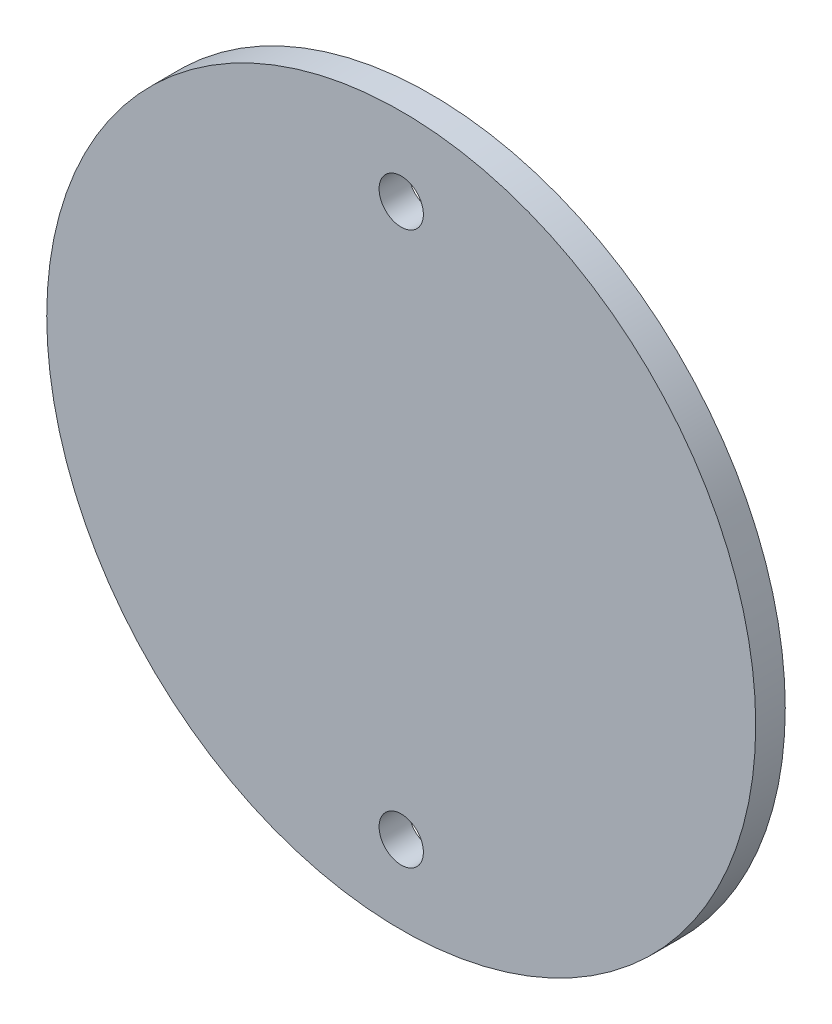
ISO-10303-21;
HEADER;
FILE_DESCRIPTION(('STEP AP214'),'2;1');
FILE_NAME('part.step','',(''),(''),'','','');
FILE_SCHEMA(('AUTOMOTIVE_DESIGN { 1 0 10303 214 1 1 1 1 }'));
ENDSEC;
DATA;
#1=APPLICATION_CONTEXT('core data for automotive mechanical design processes');
#2=APPLICATION_PROTOCOL_DEFINITION('international standard','automotive_design',2000,#1);
#3=PRODUCT_CONTEXT('',#1,'mechanical');
#4=PRODUCT('Part','Part','',(#3));
#5=PRODUCT_RELATED_PRODUCT_CATEGORY('part','',(#4));
#6=PRODUCT_DEFINITION_FORMATION('','',#4);
#7=PRODUCT_DEFINITION_CONTEXT('part definition',#1,'design');
#8=PRODUCT_DEFINITION('design','',#6,#7);
#9=PRODUCT_DEFINITION_SHAPE('','',#8);
#10=(LENGTH_UNIT() NAMED_UNIT(*) SI_UNIT(.MILLI.,.METRE.));
#11=(NAMED_UNIT(*) PLANE_ANGLE_UNIT() SI_UNIT($,.RADIAN.));
#12=(NAMED_UNIT(*) SI_UNIT($,.STERADIAN.) SOLID_ANGLE_UNIT());
#13=UNCERTAINTY_MEASURE_WITH_UNIT(LENGTH_MEASURE(1.E-05),#10,'distance_accuracy_value','');
#14=(GEOMETRIC_REPRESENTATION_CONTEXT(3) GLOBAL_UNCERTAINTY_ASSIGNED_CONTEXT((#13)) GLOBAL_UNIT_ASSIGNED_CONTEXT((#10,
#11,#12)) REPRESENTATION_CONTEXT('',''));
#15=CARTESIAN_POINT('',(0.,0.,0.));
#16=DIRECTION('',(0.,0.,1.));
#17=DIRECTION('',(1.,0.,0.));
#18=AXIS2_PLACEMENT_3D('',#15,#16,#17);
#19=CARTESIAN_POINT('',(0.,0.,6.35));
#20=DIRECTION('',(0.,0.,1.));
#21=DIRECTION('',(1.,0.,0.));
#22=AXIS2_PLACEMENT_3D('',#19,#20,#21);
#23=PLANE('',#22);
#24=CARTESIAN_POINT('',(0.,59.3725,6.35));
#25=DIRECTION('',(0.,0.,1.));
#26=DIRECTION('',(1.,0.,0.));
#27=AXIS2_PLACEMENT_3D('',#24,#25,#26);
#28=CIRCLE('',#27,4.7625);
#29=CARTESIAN_POINT('',(4.76250000000001,59.3725,6.35));
#30=VERTEX_POINT('',#29);
#31=EDGE_CURVE('E49',#30,#30,#28,.T.);
#32=ORIENTED_EDGE('',*,*,#31,.F.);
#33=EDGE_LOOP('',(#32));
#34=FACE_BOUND('',#33,.T.);
#35=CARTESIAN_POINT('',(0.,0.,6.35));
#36=DIRECTION('',(0.,0.,1.));
#37=DIRECTION('',(1.,0.,0.));
#38=AXIS2_PLACEMENT_3D('',#35,#36,#37);
#39=CIRCLE('',#38,76.2);
#40=CARTESIAN_POINT('',(76.2,0.,6.35));
#41=VERTEX_POINT('',#40);
#42=EDGE_CURVE('E10',#41,#41,#39,.T.);
#43=ORIENTED_EDGE('',*,*,#42,.T.);
#44=EDGE_LOOP('',(#43));
#45=FACE_BOUND('',#44,.T.);
#46=CARTESIAN_POINT('',(0.,-59.3725,6.35));
#47=DIRECTION('',(0.,0.,1.));
#48=DIRECTION('',(1.,0.,0.));
#49=AXIS2_PLACEMENT_3D('',#46,#47,#48);
#50=CIRCLE('',#49,4.7625);
#51=CARTESIAN_POINT('',(4.76250000000001,-59.3725,6.35));
#52=VERTEX_POINT('',#51);
#53=EDGE_CURVE('E54',#52,#52,#50,.T.);
#54=ORIENTED_EDGE('',*,*,#53,.F.);
#55=EDGE_LOOP('',(#54));
#56=FACE_BOUND('',#55,.T.);
#57=ADVANCED_FACE('F38',(#34,#45,#56),#23,.T.);
#58=CARTESIAN_POINT('',(0.,0.,0.));
#59=DIRECTION('',(0.,0.,1.));
#60=DIRECTION('',(1.,0.,0.));
#61=AXIS2_PLACEMENT_3D('',#58,#59,#60);
#62=PLANE('',#61);
#63=CARTESIAN_POINT('',(0.,0.,0.));
#64=DIRECTION('',(0.,0.,1.));
#65=DIRECTION('',(1.,0.,0.));
#66=AXIS2_PLACEMENT_3D('',#63,#64,#65);
#67=CIRCLE('',#66,76.2);
#68=CARTESIAN_POINT('',(76.2,0.,0.));
#69=VERTEX_POINT('',#68);
#70=EDGE_CURVE('E42',#69,#69,#67,.T.);
#71=ORIENTED_EDGE('',*,*,#70,.F.);
#72=EDGE_LOOP('',(#71));
#73=FACE_BOUND('',#72,.T.);
#74=CARTESIAN_POINT('',(0.,59.3725,0.));
#75=DIRECTION('',(0.,0.,1.));
#76=DIRECTION('',(1.,0.,0.));
#77=AXIS2_PLACEMENT_3D('',#74,#75,#76);
#78=CIRCLE('',#77,4.7625);
#79=CARTESIAN_POINT('',(4.76250000000001,59.3725,0.));
#80=VERTEX_POINT('',#79);
#81=EDGE_CURVE('E51',#80,#80,#78,.T.);
#82=ORIENTED_EDGE('',*,*,#81,.T.);
#83=EDGE_LOOP('',(#82));
#84=FACE_BOUND('',#83,.T.);
#85=CARTESIAN_POINT('',(0.,-59.3725,0.));
#86=DIRECTION('',(0.,0.,1.));
#87=DIRECTION('',(1.,0.,0.));
#88=AXIS2_PLACEMENT_3D('',#85,#86,#87);
#89=CIRCLE('',#88,4.7625);
#90=CARTESIAN_POINT('',(4.76250000000001,-59.3725,0.));
#91=VERTEX_POINT('',#90);
#92=EDGE_CURVE('E57',#91,#91,#89,.T.);
#93=ORIENTED_EDGE('',*,*,#92,.T.);
#94=EDGE_LOOP('',(#93));
#95=FACE_BOUND('',#94,.T.);
#96=ADVANCED_FACE('F67',(#73,#84,#95),#62,.F.);
#97=CARTESIAN_POINT('',(0.,0.,6.35));
#98=DIRECTION('',(0.,0.,-1.));
#99=DIRECTION('',(-1.,0.,0.));
#100=AXIS2_PLACEMENT_3D('',#97,#98,#99);
#101=CYLINDRICAL_SURFACE('',#100,76.2);
#102=ORIENTED_EDGE('',*,*,#42,.F.);
#103=EDGE_LOOP('',(#102));
#104=FACE_BOUND('',#103,.T.);
#105=ORIENTED_EDGE('',*,*,#70,.T.);
#106=EDGE_LOOP('',(#105));
#107=FACE_BOUND('',#106,.T.);
#108=ADVANCED_FACE('F40',(#104,#107),#101,.T.);
#109=CARTESIAN_POINT('',(0.,59.3725,6.35));
#110=DIRECTION('',(0.,0.,-1.));
#111=DIRECTION('',(-1.,0.,0.));
#112=AXIS2_PLACEMENT_3D('',#109,#110,#111);
#113=CYLINDRICAL_SURFACE('',#112,4.7625);
#114=ORIENTED_EDGE('',*,*,#31,.T.);
#115=EDGE_LOOP('',(#114));
#116=FACE_BOUND('',#115,.T.);
#117=ORIENTED_EDGE('',*,*,#81,.F.);
#118=EDGE_LOOP('',(#117));
#119=FACE_BOUND('',#118,.T.);
#120=ADVANCED_FACE('F76',(#116,#119),#113,.F.);
#121=CARTESIAN_POINT('',(0.,-59.3725,6.35));
#122=DIRECTION('',(0.,0.,-1.));
#123=DIRECTION('',(-1.,0.,0.));
#124=AXIS2_PLACEMENT_3D('',#121,#122,#123);
#125=CYLINDRICAL_SURFACE('',#124,4.7625);
#126=ORIENTED_EDGE('',*,*,#53,.T.);
#127=EDGE_LOOP('',(#126));
#128=FACE_BOUND('',#127,.T.);
#129=ORIENTED_EDGE('',*,*,#92,.F.);
#130=EDGE_LOOP('',(#129));
#131=FACE_BOUND('',#130,.T.);
#132=ADVANCED_FACE('F63',(#128,#131),#125,.F.);
#133=CLOSED_SHELL('',(#57,#96,#108,#120,#132));
#134=MANIFOLD_SOLID_BREP('B2',#133);
#135=ADVANCED_BREP_SHAPE_REPRESENTATION('',(#18,#134),#14);
#136=SHAPE_DEFINITION_REPRESENTATION(#9,#135);
ENDSEC;
END-ISO-10303-21;
